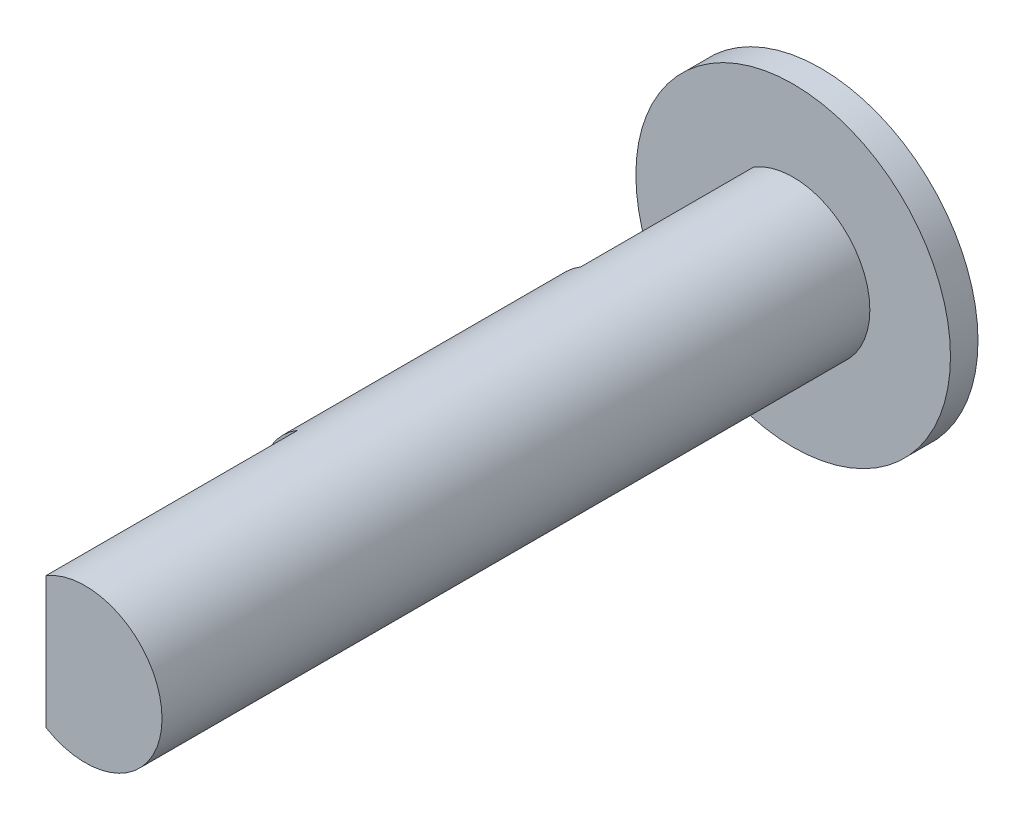
ISO-10303-21;
HEADER;
FILE_DESCRIPTION(('STEP AP214'),'2;1');
FILE_NAME('part.step','',(''),(''),'','','');
FILE_SCHEMA(('AUTOMOTIVE_DESIGN { 1 0 10303 214 1 1 1 1 }'));
ENDSEC;
DATA;
#1=APPLICATION_CONTEXT('core data for automotive mechanical design processes');
#2=APPLICATION_PROTOCOL_DEFINITION('international standard','automotive_design',2000,#1);
#3=PRODUCT_CONTEXT('',#1,'mechanical');
#4=PRODUCT('Part','Part','',(#3));
#5=PRODUCT_RELATED_PRODUCT_CATEGORY('part','',(#4));
#6=PRODUCT_DEFINITION_FORMATION('','',#4);
#7=PRODUCT_DEFINITION_CONTEXT('part definition',#1,'design');
#8=PRODUCT_DEFINITION('design','',#6,#7);
#9=PRODUCT_DEFINITION_SHAPE('','',#8);
#10=(LENGTH_UNIT() NAMED_UNIT(*) SI_UNIT(.MILLI.,.METRE.));
#11=(NAMED_UNIT(*) PLANE_ANGLE_UNIT() SI_UNIT($,.RADIAN.));
#12=(NAMED_UNIT(*) SI_UNIT($,.STERADIAN.) SOLID_ANGLE_UNIT());
#13=UNCERTAINTY_MEASURE_WITH_UNIT(LENGTH_MEASURE(1.E-05),#10,'distance_accuracy_value','');
#14=(GEOMETRIC_REPRESENTATION_CONTEXT(3) GLOBAL_UNCERTAINTY_ASSIGNED_CONTEXT((#13)) GLOBAL_UNIT_ASSIGNED_CONTEXT((#10,
#11,#12)) REPRESENTATION_CONTEXT('',''));
#15=CARTESIAN_POINT('',(0.,0.,0.));
#16=DIRECTION('',(0.,0.,1.));
#17=DIRECTION('',(1.,0.,0.));
#18=AXIS2_PLACEMENT_3D('',#15,#16,#17);
#19=CARTESIAN_POINT('',(0.,0.,9.));
#20=DIRECTION('',(0.,0.,-1.));
#21=DIRECTION('',(-1.,0.,0.));
#22=AXIS2_PLACEMENT_3D('',#19,#20,#21);
#23=CYLINDRICAL_SURFACE('',#22,1.95);
#24=CARTESIAN_POINT('',(0.,0.,9.));
#25=DIRECTION('',(0.,0.,1.));
#26=DIRECTION('',(1.,0.,0.));
#27=AXIS2_PLACEMENT_3D('',#24,#25,#26);
#28=CIRCLE('',#27,1.95);
#29=CARTESIAN_POINT('',(-1.,-1.67406690427832,9.));
#30=VERTEX_POINT('',#29);
#31=CARTESIAN_POINT('',(-1.,1.67406690427832,9.));
#32=VERTEX_POINT('',#31);
#33=EDGE_CURVE('E11',#30,#32,#28,.T.);
#34=ORIENTED_EDGE('',*,*,#33,.F.);
#35=DIRECTION('',(0.,0.,1.));
#36=VECTOR('',#35,1.);
#37=CARTESIAN_POINT('',(-1.,-1.67406690427832,2.6));
#38=LINE('',#37,#36);
#39=CARTESIAN_POINT('',(-1.,-1.67406690427832,2.6));
#40=VERTEX_POINT('',#39);
#41=EDGE_CURVE('E54',#40,#30,#38,.T.);
#42=ORIENTED_EDGE('',*,*,#41,.F.);
#43=CARTESIAN_POINT('',(0.,0.,2.6));
#44=DIRECTION('',(0.,0.,1.));
#45=DIRECTION('',(1.,0.,0.));
#46=AXIS2_PLACEMENT_3D('',#43,#44,#45);
#47=CIRCLE('',#46,1.95);
#48=CARTESIAN_POINT('',(-1.,1.67406690427832,2.6));
#49=VERTEX_POINT('',#48);
#50=EDGE_CURVE('E87',#49,#40,#47,.T.);
#51=ORIENTED_EDGE('',*,*,#50,.F.);
#52=DIRECTION('',(0.,0.,1.));
#53=VECTOR('',#52,1.);
#54=CARTESIAN_POINT('',(-1.,1.67406690427832,2.6));
#55=LINE('',#54,#53);
#56=EDGE_CURVE('E96',#49,#32,#55,.T.);
#57=ORIENTED_EDGE('',*,*,#56,.T.);
#58=EDGE_LOOP('',(#34,#42,#51,#57));
#59=FACE_BOUND('',#58,.T.);
#60=CARTESIAN_POINT('',(0.,0.,-4.6));
#61=DIRECTION('',(0.,0.,-1.));
#62=DIRECTION('',(-1.,0.,0.));
#63=AXIS2_PLACEMENT_3D('',#60,#61,#62);
#64=CIRCLE('',#63,1.95);
#65=CARTESIAN_POINT('',(-1.,-1.67406690427832,-4.6));
#66=VERTEX_POINT('',#65);
#67=CARTESIAN_POINT('',(-1.,1.67406690427832,-4.6));
#68=VERTEX_POINT('',#67);
#69=EDGE_CURVE('E115',#66,#68,#64,.T.);
#70=ORIENTED_EDGE('',*,*,#69,.F.);
#71=DIRECTION('',(0.,0.,-1.));
#72=VECTOR('',#71,1.);
#73=CARTESIAN_POINT('',(-1.,-1.67406690427832,-4.6));
#74=LINE('',#73,#72);
#75=CARTESIAN_POINT('',(-1.,-1.67406690427832,-9.));
#76=VERTEX_POINT('',#75);
#77=EDGE_CURVE('E63',#66,#76,#74,.T.);
#78=ORIENTED_EDGE('',*,*,#77,.T.);
#79=CARTESIAN_POINT('',(0.,0.,-9.));
#80=DIRECTION('',(0.,0.,1.));
#81=DIRECTION('',(1.,0.,0.));
#82=AXIS2_PLACEMENT_3D('',#79,#80,#81);
#83=CIRCLE('',#82,1.95);
#84=CARTESIAN_POINT('',(-1.,1.67406690427832,-9.));
#85=VERTEX_POINT('',#84);
#86=EDGE_CURVE('E42',#76,#85,#83,.T.);
#87=ORIENTED_EDGE('',*,*,#86,.T.);
#88=DIRECTION('',(0.,0.,-1.));
#89=VECTOR('',#88,1.);
#90=CARTESIAN_POINT('',(-1.,1.67406690427832,-4.6));
#91=LINE('',#90,#89);
#92=EDGE_CURVE('E121',#68,#85,#91,.T.);
#93=ORIENTED_EDGE('',*,*,#92,.F.);
#94=EDGE_LOOP('',(#70,#78,#87,#93));
#95=FACE_BOUND('',#94,.T.);
#96=ADVANCED_FACE('F39',(#59,#95),#23,.T.);
#97=CARTESIAN_POINT('',(0.,0.,9.));
#98=DIRECTION('',(0.,0.,1.));
#99=DIRECTION('',(1.,0.,0.));
#100=AXIS2_PLACEMENT_3D('',#97,#98,#99);
#101=PLANE('',#100);
#102=DIRECTION('',(0.,1.,0.));
#103=VECTOR('',#102,1.);
#104=CARTESIAN_POINT('',(-1.,1.67406690427832,9.));
#105=LINE('',#104,#103);
#106=EDGE_CURVE('E93',#30,#32,#105,.T.);
#107=ORIENTED_EDGE('',*,*,#106,.F.);
#108=ORIENTED_EDGE('',*,*,#33,.T.);
#109=EDGE_LOOP('',(#107,#108));
#110=FACE_BOUND('',#109,.T.);
#111=ADVANCED_FACE('F143',(#110),#101,.T.);
#112=CARTESIAN_POINT('',(-1.,1.67406690427832,-4.6));
#113=DIRECTION('',(1.,0.,0.));
#114=DIRECTION('',(0.,0.,-1.));
#115=AXIS2_PLACEMENT_3D('',#112,#113,#114);
#116=PLANE('',#115);
#117=DIRECTION('',(0.,-1.,0.));
#118=VECTOR('',#117,1.);
#119=CARTESIAN_POINT('',(-1.,1.67406690427832,-9.));
#120=LINE('',#119,#118);
#121=EDGE_CURVE('E75',#85,#76,#120,.T.);
#122=ORIENTED_EDGE('',*,*,#121,.T.);
#123=ORIENTED_EDGE('',*,*,#77,.F.);
#124=DIRECTION('',(0.,-1.,0.));
#125=VECTOR('',#124,1.);
#126=CARTESIAN_POINT('',(-1.,1.67406690427832,-4.6));
#127=LINE('',#126,#125);
#128=EDGE_CURVE('E118',#68,#66,#127,.T.);
#129=ORIENTED_EDGE('',*,*,#128,.F.);
#130=ORIENTED_EDGE('',*,*,#92,.T.);
#131=EDGE_LOOP('',(#122,#123,#129,#130));
#132=FACE_BOUND('',#131,.T.);
#133=ADVANCED_FACE('F128',(#132),#116,.F.);
#134=CARTESIAN_POINT('',(0.,0.,-4.6));
#135=DIRECTION('',(0.,0.,-1.));
#136=DIRECTION('',(-1.,0.,0.));
#137=AXIS2_PLACEMENT_3D('',#134,#135,#136);
#138=PLANE('',#137);
#139=ORIENTED_EDGE('',*,*,#69,.T.);
#140=ORIENTED_EDGE('',*,*,#128,.T.);
#141=EDGE_LOOP('',(#139,#140));
#142=FACE_BOUND('',#141,.T.);
#143=ADVANCED_FACE('F132',(#142),#138,.T.);
#144=CARTESIAN_POINT('',(0.,0.,-9.7));
#145=DIRECTION('',(0.,0.,1.));
#146=DIRECTION('',(1.,0.,0.));
#147=AXIS2_PLACEMENT_3D('',#144,#145,#146);
#148=CYLINDRICAL_SURFACE('',#147,4.);
#149=CARTESIAN_POINT('',(0.,0.,-9.7));
#150=DIRECTION('',(0.,0.,-1.));
#151=DIRECTION('',(-1.,0.,0.));
#152=AXIS2_PLACEMENT_3D('',#149,#150,#151);
#153=CIRCLE('',#152,4.);
#154=CARTESIAN_POINT('',(-4.,0.,-9.7));
#155=VERTEX_POINT('',#154);
#156=EDGE_CURVE('E108',#155,#155,#153,.T.);
#157=ORIENTED_EDGE('',*,*,#156,.F.);
#158=EDGE_LOOP('',(#157));
#159=FACE_BOUND('',#158,.T.);
#160=CARTESIAN_POINT('',(0.,0.,-9.));
#161=DIRECTION('',(0.,0.,-1.));
#162=DIRECTION('',(-1.,0.,0.));
#163=AXIS2_PLACEMENT_3D('',#160,#161,#162);
#164=CIRCLE('',#163,4.);
#165=CARTESIAN_POINT('',(-4.,0.,-9.));
#166=VERTEX_POINT('',#165);
#167=EDGE_CURVE('E104',#166,#166,#164,.T.);
#168=ORIENTED_EDGE('',*,*,#167,.T.);
#169=EDGE_LOOP('',(#168));
#170=FACE_BOUND('',#169,.T.);
#171=ADVANCED_FACE('F134',(#159,#170),#148,.T.);
#172=CARTESIAN_POINT('',(0.,0.,-9.7));
#173=DIRECTION('',(0.,0.,-1.));
#174=DIRECTION('',(-1.,0.,0.));
#175=AXIS2_PLACEMENT_3D('',#172,#173,#174);
#176=PLANE('',#175);
#177=ORIENTED_EDGE('',*,*,#156,.T.);
#178=EDGE_LOOP('',(#177));
#179=FACE_BOUND('',#178,.T.);
#180=ADVANCED_FACE('F140',(#179),#176,.T.);
#181=CARTESIAN_POINT('',(0.,0.,-9.));
#182=DIRECTION('',(0.,0.,-1.));
#183=DIRECTION('',(-1.,0.,0.));
#184=AXIS2_PLACEMENT_3D('',#181,#182,#183);
#185=PLANE('',#184);
#186=ORIENTED_EDGE('',*,*,#86,.F.);
#187=ORIENTED_EDGE('',*,*,#121,.F.);
#188=EDGE_LOOP('',(#186,#187));
#189=FACE_BOUND('',#188,.T.);
#190=ORIENTED_EDGE('',*,*,#167,.F.);
#191=EDGE_LOOP('',(#190));
#192=FACE_BOUND('',#191,.T.);
#193=ADVANCED_FACE('F175',(#189,#192),#185,.F.);
#194=CARTESIAN_POINT('',(-1.,1.67406690427832,2.6));
#195=DIRECTION('',(1.,0.,0.));
#196=DIRECTION('',(0.,0.,-1.));
#197=AXIS2_PLACEMENT_3D('',#194,#195,#196);
#198=PLANE('',#197);
#199=ORIENTED_EDGE('',*,*,#106,.T.);
#200=ORIENTED_EDGE('',*,*,#56,.F.);
#201=DIRECTION('',(0.,1.,0.));
#202=VECTOR('',#201,1.);
#203=CARTESIAN_POINT('',(-1.,1.67406690427832,2.6));
#204=LINE('',#203,#202);
#205=EDGE_CURVE('E89',#40,#49,#204,.T.);
#206=ORIENTED_EDGE('',*,*,#205,.F.);
#207=ORIENTED_EDGE('',*,*,#41,.T.);
#208=EDGE_LOOP('',(#199,#200,#206,#207));
#209=FACE_BOUND('',#208,.T.);
#210=ADVANCED_FACE('F95',(#209),#198,.F.);
#211=CARTESIAN_POINT('',(0.,0.,2.6));
#212=DIRECTION('',(0.,0.,1.));
#213=DIRECTION('',(1.,0.,0.));
#214=AXIS2_PLACEMENT_3D('',#211,#212,#213);
#215=PLANE('',#214);
#216=ORIENTED_EDGE('',*,*,#50,.T.);
#217=ORIENTED_EDGE('',*,*,#205,.T.);
#218=EDGE_LOOP('',(#216,#217));
#219=FACE_BOUND('',#218,.T.);
#220=ADVANCED_FACE('F88',(#219),#215,.T.);
#221=CLOSED_SHELL('',(#96,#111,#133,#143,#171,#180,#193,#210,#220));
#222=MANIFOLD_SOLID_BREP('B2',#221);
#223=ADVANCED_BREP_SHAPE_REPRESENTATION('',(#18,#222),#14);
#224=SHAPE_DEFINITION_REPRESENTATION(#9,#223);
ENDSEC;
END-ISO-10303-21;
